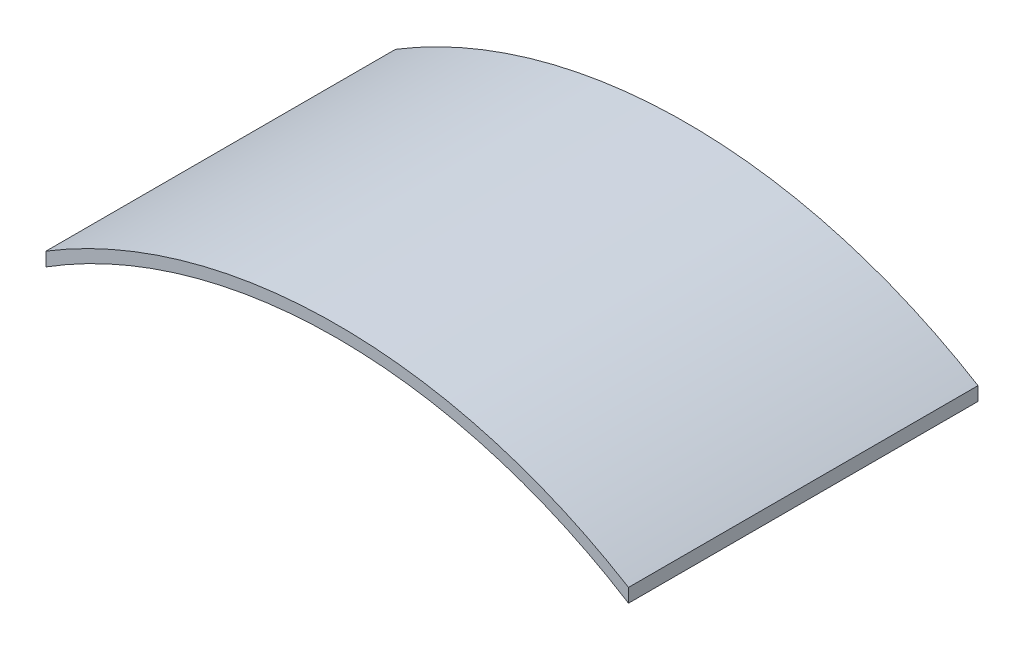
ISO-10303-21;
HEADER;
FILE_DESCRIPTION(('STEP AP214'),'2;1');
FILE_NAME('part.step','',(''),(''),'','','');
FILE_SCHEMA(('AUTOMOTIVE_DESIGN { 1 0 10303 214 1 1 1 1 }'));
ENDSEC;
DATA;
#1=APPLICATION_CONTEXT('core data for automotive mechanical design processes');
#2=APPLICATION_PROTOCOL_DEFINITION('international standard','automotive_design',2000,#1);
#3=PRODUCT_CONTEXT('',#1,'mechanical');
#4=PRODUCT('Part','Part','',(#3));
#5=PRODUCT_RELATED_PRODUCT_CATEGORY('part','',(#4));
#6=PRODUCT_DEFINITION_FORMATION('','',#4);
#7=PRODUCT_DEFINITION_CONTEXT('part definition',#1,'design');
#8=PRODUCT_DEFINITION('design','',#6,#7);
#9=PRODUCT_DEFINITION_SHAPE('','',#8);
#10=(LENGTH_UNIT() NAMED_UNIT(*) SI_UNIT(.MILLI.,.METRE.));
#11=(NAMED_UNIT(*) PLANE_ANGLE_UNIT() SI_UNIT($,.RADIAN.));
#12=(NAMED_UNIT(*) SI_UNIT($,.STERADIAN.) SOLID_ANGLE_UNIT());
#13=UNCERTAINTY_MEASURE_WITH_UNIT(LENGTH_MEASURE(1.E-05),#10,'distance_accuracy_value','');
#14=(GEOMETRIC_REPRESENTATION_CONTEXT(3) GLOBAL_UNCERTAINTY_ASSIGNED_CONTEXT((#13)) GLOBAL_UNIT_ASSIGNED_CONTEXT((#10,
#11,#12)) REPRESENTATION_CONTEXT('',''));
#15=CARTESIAN_POINT('',(0.,0.,0.));
#16=DIRECTION('',(0.,0.,1.));
#17=DIRECTION('',(1.,0.,0.));
#18=AXIS2_PLACEMENT_3D('',#15,#16,#17);
#19=CARTESIAN_POINT('',(0.,0.,30.));
#20=DIRECTION('',(0.,0.,-1.));
#21=DIRECTION('',(-1.,0.,0.));
#22=AXIS2_PLACEMENT_3D('',#19,#20,#21);
#23=CYLINDRICAL_SURFACE('',#22,47.);
#24=DIRECTION('',(0.,0.,-1.));
#25=VECTOR('',#24,1.);
#26=CARTESIAN_POINT('',(25.,39.7994974842648,30.));
#27=LINE('',#26,#25);
#28=CARTESIAN_POINT('',(25.,39.7994974842648,30.));
#29=VERTEX_POINT('',#28);
#30=CARTESIAN_POINT('',(25.,39.7994974842648,0.));
#31=VERTEX_POINT('',#30);
#32=EDGE_CURVE('E54',#29,#31,#27,.T.);
#33=ORIENTED_EDGE('',*,*,#32,.F.);
#34=CARTESIAN_POINT('',(0.,0.,30.));
#35=DIRECTION('',(0.,0.,-1.));
#36=DIRECTION('',(1.,0.,0.));
#37=AXIS2_PLACEMENT_3D('',#34,#35,#36);
#38=CIRCLE('',#37,47.);
#39=CARTESIAN_POINT('',(-25.,39.7994974842648,30.));
#40=VERTEX_POINT('',#39);
#41=EDGE_CURVE('E85',#40,#29,#38,.T.);
#42=ORIENTED_EDGE('',*,*,#41,.F.);
#43=DIRECTION('',(0.,0.,-1.));
#44=VECTOR('',#43,1.);
#45=CARTESIAN_POINT('',(-25.,39.7994974842648,30.));
#46=LINE('',#45,#44);
#47=CARTESIAN_POINT('',(-25.,39.7994974842648,0.));
#48=VERTEX_POINT('',#47);
#49=EDGE_CURVE('E70',#40,#48,#46,.T.);
#50=ORIENTED_EDGE('',*,*,#49,.T.);
#51=CARTESIAN_POINT('',(0.,0.,0.));
#52=DIRECTION('',(0.,0.,-1.));
#53=DIRECTION('',(1.,0.,0.));
#54=AXIS2_PLACEMENT_3D('',#51,#52,#53);
#55=CIRCLE('',#54,47.);
#56=EDGE_CURVE('E94',#48,#31,#55,.T.);
#57=ORIENTED_EDGE('',*,*,#56,.T.);
#58=EDGE_LOOP('',(#33,#42,#50,#57));
#59=FACE_BOUND('',#58,.T.);
#60=ADVANCED_FACE('F33',(#59),#23,.F.);
#61=CARTESIAN_POINT('',(0.,0.,30.));
#62=DIRECTION('',(0.,0.,-1.));
#63=DIRECTION('',(-1.,0.,0.));
#64=AXIS2_PLACEMENT_3D('',#61,#62,#63);
#65=CYLINDRICAL_SURFACE('',#64,48.);
#66=DIRECTION('',(0.,0.,-1.));
#67=VECTOR('',#66,1.);
#68=CARTESIAN_POINT('',(25.,40.9756024970957,30.));
#69=LINE('',#68,#67);
#70=CARTESIAN_POINT('',(25.,40.9756024970957,0.));
#71=VERTEX_POINT('',#70);
#72=CARTESIAN_POINT('',(25.,40.9756024970957,30.));
#73=VERTEX_POINT('',#72);
#74=EDGE_CURVE('E78',#71,#73,#69,.F.);
#75=ORIENTED_EDGE('',*,*,#74,.F.);
#76=CARTESIAN_POINT('',(0.,0.,0.));
#77=DIRECTION('',(0.,0.,1.));
#78=DIRECTION('',(1.,0.,0.));
#79=AXIS2_PLACEMENT_3D('',#76,#77,#78);
#80=CIRCLE('',#79,48.);
#81=CARTESIAN_POINT('',(-25.,40.9756024970958,0.));
#82=VERTEX_POINT('',#81);
#83=EDGE_CURVE('E90',#71,#82,#80,.T.);
#84=ORIENTED_EDGE('',*,*,#83,.T.);
#85=DIRECTION('',(0.,0.,-1.));
#86=VECTOR('',#85,1.);
#87=CARTESIAN_POINT('',(-25.,40.9756024970958,30.));
#88=LINE('',#87,#86);
#89=CARTESIAN_POINT('',(-25.,40.9756024970957,30.));
#90=VERTEX_POINT('',#89);
#91=EDGE_CURVE('E47',#82,#90,#88,.F.);
#92=ORIENTED_EDGE('',*,*,#91,.T.);
#93=CARTESIAN_POINT('',(0.,0.,30.));
#94=DIRECTION('',(0.,0.,1.));
#95=DIRECTION('',(1.,0.,0.));
#96=AXIS2_PLACEMENT_3D('',#93,#94,#95);
#97=CIRCLE('',#96,48.);
#98=EDGE_CURVE('E87',#73,#90,#97,.T.);
#99=ORIENTED_EDGE('',*,*,#98,.F.);
#100=EDGE_LOOP('',(#75,#84,#92,#99));
#101=FACE_BOUND('',#100,.T.);
#102=ADVANCED_FACE('F104',(#101),#65,.T.);
#103=CARTESIAN_POINT('',(0.,0.,30.));
#104=DIRECTION('',(0.,0.,1.));
#105=DIRECTION('',(1.,0.,0.));
#106=AXIS2_PLACEMENT_3D('',#103,#104,#105);
#107=PLANE('',#106);
#108=ORIENTED_EDGE('',*,*,#41,.T.);
#109=DIRECTION('',(0.,1.,0.));
#110=VECTOR('',#109,1.);
#111=CARTESIAN_POINT('',(25.,-97.,30.));
#112=LINE('',#111,#110);
#113=EDGE_CURVE('E88',#29,#73,#112,.T.);
#114=ORIENTED_EDGE('',*,*,#113,.T.);
#115=ORIENTED_EDGE('',*,*,#98,.T.);
#116=DIRECTION('',(0.,1.,0.));
#117=VECTOR('',#116,1.);
#118=CARTESIAN_POINT('',(-25.,-97.,30.));
#119=LINE('',#118,#117);
#120=EDGE_CURVE('E73',#40,#90,#119,.T.);
#121=ORIENTED_EDGE('',*,*,#120,.F.);
#122=EDGE_LOOP('',(#108,#114,#115,#121));
#123=FACE_BOUND('',#122,.T.);
#124=ADVANCED_FACE('F83',(#123),#107,.T.);
#125=CARTESIAN_POINT('',(0.,0.,0.));
#126=DIRECTION('',(0.,0.,1.));
#127=DIRECTION('',(1.,0.,0.));
#128=AXIS2_PLACEMENT_3D('',#125,#126,#127);
#129=PLANE('',#128);
#130=DIRECTION('',(0.,1.,0.));
#131=VECTOR('',#130,1.);
#132=CARTESIAN_POINT('',(25.,0.,0.));
#133=LINE('',#132,#131);
#134=EDGE_CURVE('E11',#31,#71,#133,.T.);
#135=ORIENTED_EDGE('',*,*,#134,.F.);
#136=ORIENTED_EDGE('',*,*,#56,.F.);
#137=DIRECTION('',(0.,1.,0.));
#138=VECTOR('',#137,1.);
#139=CARTESIAN_POINT('',(-25.,0.,0.));
#140=LINE('',#139,#138);
#141=EDGE_CURVE('E40',#48,#82,#140,.T.);
#142=ORIENTED_EDGE('',*,*,#141,.T.);
#143=ORIENTED_EDGE('',*,*,#83,.F.);
#144=EDGE_LOOP('',(#135,#136,#142,#143));
#145=FACE_BOUND('',#144,.T.);
#146=ADVANCED_FACE('F101',(#145),#129,.F.);
#147=CARTESIAN_POINT('',(-25.,-97.,0.));
#148=DIRECTION('',(1.,0.,0.));
#149=DIRECTION('',(0.,0.,-1.));
#150=AXIS2_PLACEMENT_3D('',#147,#148,#149);
#151=PLANE('',#150);
#152=ORIENTED_EDGE('',*,*,#120,.T.);
#153=ORIENTED_EDGE('',*,*,#91,.F.);
#154=ORIENTED_EDGE('',*,*,#141,.F.);
#155=ORIENTED_EDGE('',*,*,#49,.F.);
#156=EDGE_LOOP('',(#152,#153,#154,#155));
#157=FACE_BOUND('',#156,.T.);
#158=ADVANCED_FACE('F72',(#157),#151,.F.);
#159=CARTESIAN_POINT('',(25.,-97.,0.));
#160=DIRECTION('',(1.,0.,0.));
#161=DIRECTION('',(0.,0.,-1.));
#162=AXIS2_PLACEMENT_3D('',#159,#160,#161);
#163=PLANE('',#162);
#164=ORIENTED_EDGE('',*,*,#32,.T.);
#165=ORIENTED_EDGE('',*,*,#134,.T.);
#166=ORIENTED_EDGE('',*,*,#74,.T.);
#167=ORIENTED_EDGE('',*,*,#113,.F.);
#168=EDGE_LOOP('',(#164,#165,#166,#167));
#169=FACE_BOUND('',#168,.T.);
#170=ADVANCED_FACE('F107',(#169),#163,.T.);
#171=CLOSED_SHELL('',(#60,#102,#124,#146,#158,#170));
#172=MANIFOLD_SOLID_BREP('B2',#171);
#173=ADVANCED_BREP_SHAPE_REPRESENTATION('',(#18,#172),#14);
#174=SHAPE_DEFINITION_REPRESENTATION(#9,#173);
ENDSEC;
END-ISO-10303-21;
